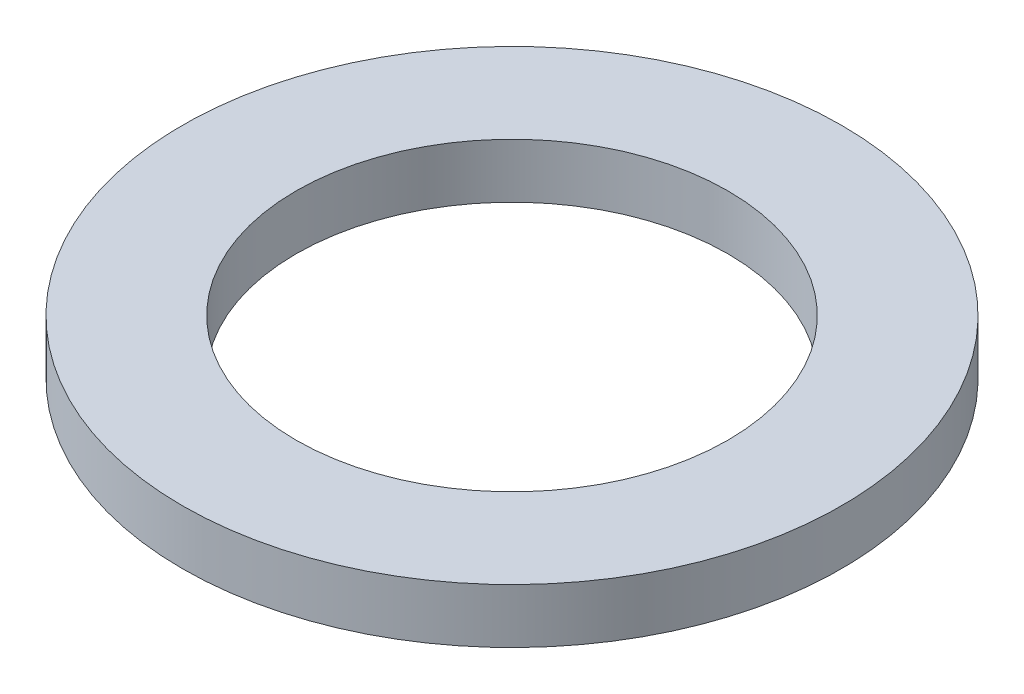
ISO-10303-21;
HEADER;
FILE_DESCRIPTION(('STEP AP214'),'2;1');
FILE_NAME('part.step','',(''),(''),'','','');
FILE_SCHEMA(('AUTOMOTIVE_DESIGN { 1 0 10303 214 1 1 1 1 }'));
ENDSEC;
DATA;
#1=APPLICATION_CONTEXT('core data for automotive mechanical design processes');
#2=APPLICATION_PROTOCOL_DEFINITION('international standard','automotive_design',2000,#1);
#3=PRODUCT_CONTEXT('',#1,'mechanical');
#4=PRODUCT('Part','Part','',(#3));
#5=PRODUCT_RELATED_PRODUCT_CATEGORY('part','',(#4));
#6=PRODUCT_DEFINITION_FORMATION('','',#4);
#7=PRODUCT_DEFINITION_CONTEXT('part definition',#1,'design');
#8=PRODUCT_DEFINITION('design','',#6,#7);
#9=PRODUCT_DEFINITION_SHAPE('','',#8);
#10=(LENGTH_UNIT() NAMED_UNIT(*) SI_UNIT(.MILLI.,.METRE.));
#11=(NAMED_UNIT(*) PLANE_ANGLE_UNIT() SI_UNIT($,.RADIAN.));
#12=(NAMED_UNIT(*) SI_UNIT($,.STERADIAN.) SOLID_ANGLE_UNIT());
#13=UNCERTAINTY_MEASURE_WITH_UNIT(LENGTH_MEASURE(1.E-05),#10,'distance_accuracy_value','');
#14=(GEOMETRIC_REPRESENTATION_CONTEXT(3) GLOBAL_UNCERTAINTY_ASSIGNED_CONTEXT((#13)) GLOBAL_UNIT_ASSIGNED_CONTEXT((#10,
#11,#12)) REPRESENTATION_CONTEXT('',''));
#15=CARTESIAN_POINT('',(0.,0.,0.));
#16=DIRECTION('',(0.,0.,1.));
#17=DIRECTION('',(1.,0.,0.));
#18=AXIS2_PLACEMENT_3D('',#15,#16,#17);
#19=CARTESIAN_POINT('',(0.,12.,0.));
#20=DIRECTION('',(0.,-1.,0.));
#21=DIRECTION('',(0.,0.,-1.));
#22=AXIS2_PLACEMENT_3D('',#19,#20,#21);
#23=CYLINDRICAL_SURFACE('',#22,72.5);
#24=CARTESIAN_POINT('',(0.,12.,0.));
#25=DIRECTION('',(0.,1.,0.));
#26=DIRECTION('',(0.,0.,1.));
#27=AXIS2_PLACEMENT_3D('',#24,#25,#26);
#28=CIRCLE('',#27,72.5);
#29=CARTESIAN_POINT('',(0.,12.,72.5));
#30=VERTEX_POINT('',#29);
#31=EDGE_CURVE('E10',#30,#30,#28,.T.);
#32=ORIENTED_EDGE('',*,*,#31,.F.);
#33=EDGE_LOOP('',(#32));
#34=FACE_BOUND('',#33,.T.);
#35=CARTESIAN_POINT('',(0.,0.,0.));
#36=DIRECTION('',(0.,1.,0.));
#37=DIRECTION('',(0.,0.,1.));
#38=AXIS2_PLACEMENT_3D('',#35,#36,#37);
#39=CIRCLE('',#38,72.5);
#40=CARTESIAN_POINT('',(0.,0.,72.5));
#41=VERTEX_POINT('',#40);
#42=EDGE_CURVE('E37',#41,#41,#39,.T.);
#43=ORIENTED_EDGE('',*,*,#42,.T.);
#44=EDGE_LOOP('',(#43));
#45=FACE_BOUND('',#44,.T.);
#46=ADVANCED_FACE('F40',(#34,#45),#23,.T.);
#47=CARTESIAN_POINT('',(0.,12.,0.));
#48=DIRECTION('',(0.,1.,0.));
#49=DIRECTION('',(0.,0.,1.));
#50=AXIS2_PLACEMENT_3D('',#47,#48,#49);
#51=PLANE('',#50);
#52=CARTESIAN_POINT('',(0.,12.,0.));
#53=DIRECTION('',(0.,1.,0.));
#54=DIRECTION('',(0.,0.,1.));
#55=AXIS2_PLACEMENT_3D('',#52,#53,#54);
#56=CIRCLE('',#55,47.5);
#57=CARTESIAN_POINT('',(0.,12.,47.5));
#58=VERTEX_POINT('',#57);
#59=EDGE_CURVE('E50',#58,#58,#56,.T.);
#60=ORIENTED_EDGE('',*,*,#59,.F.);
#61=EDGE_LOOP('',(#60));
#62=FACE_BOUND('',#61,.T.);
#63=ORIENTED_EDGE('',*,*,#31,.T.);
#64=EDGE_LOOP('',(#63));
#65=FACE_BOUND('',#64,.T.);
#66=ADVANCED_FACE('F59',(#62,#65),#51,.T.);
#67=CARTESIAN_POINT('',(0.,0.,0.));
#68=DIRECTION('',(0.,1.,0.));
#69=DIRECTION('',(0.,0.,1.));
#70=AXIS2_PLACEMENT_3D('',#67,#68,#69);
#71=PLANE('',#70);
#72=CARTESIAN_POINT('',(0.,0.,0.));
#73=DIRECTION('',(0.,1.,0.));
#74=DIRECTION('',(0.,0.,1.));
#75=AXIS2_PLACEMENT_3D('',#72,#73,#74);
#76=CIRCLE('',#75,47.5);
#77=CARTESIAN_POINT('',(0.,0.,47.5));
#78=VERTEX_POINT('',#77);
#79=EDGE_CURVE('E47',#78,#78,#76,.T.);
#80=ORIENTED_EDGE('',*,*,#79,.T.);
#81=EDGE_LOOP('',(#80));
#82=FACE_BOUND('',#81,.T.);
#83=ORIENTED_EDGE('',*,*,#42,.F.);
#84=EDGE_LOOP('',(#83));
#85=FACE_BOUND('',#84,.T.);
#86=ADVANCED_FACE('F58',(#82,#85),#71,.F.);
#87=CARTESIAN_POINT('',(0.,12.,0.));
#88=DIRECTION('',(0.,-1.,0.));
#89=DIRECTION('',(0.,0.,-1.));
#90=AXIS2_PLACEMENT_3D('',#87,#88,#89);
#91=CYLINDRICAL_SURFACE('',#90,47.5);
#92=ORIENTED_EDGE('',*,*,#59,.T.);
#93=EDGE_LOOP('',(#92));
#94=FACE_BOUND('',#93,.T.);
#95=ORIENTED_EDGE('',*,*,#79,.F.);
#96=EDGE_LOOP('',(#95));
#97=FACE_BOUND('',#96,.T.);
#98=ADVANCED_FACE('F54',(#94,#97),#91,.F.);
#99=CLOSED_SHELL('',(#46,#66,#86,#98));
#100=MANIFOLD_SOLID_BREP('B2',#99);
#101=ADVANCED_BREP_SHAPE_REPRESENTATION('',(#18,#100),#14);
#102=SHAPE_DEFINITION_REPRESENTATION(#9,#101);
ENDSEC;
END-ISO-10303-21;
